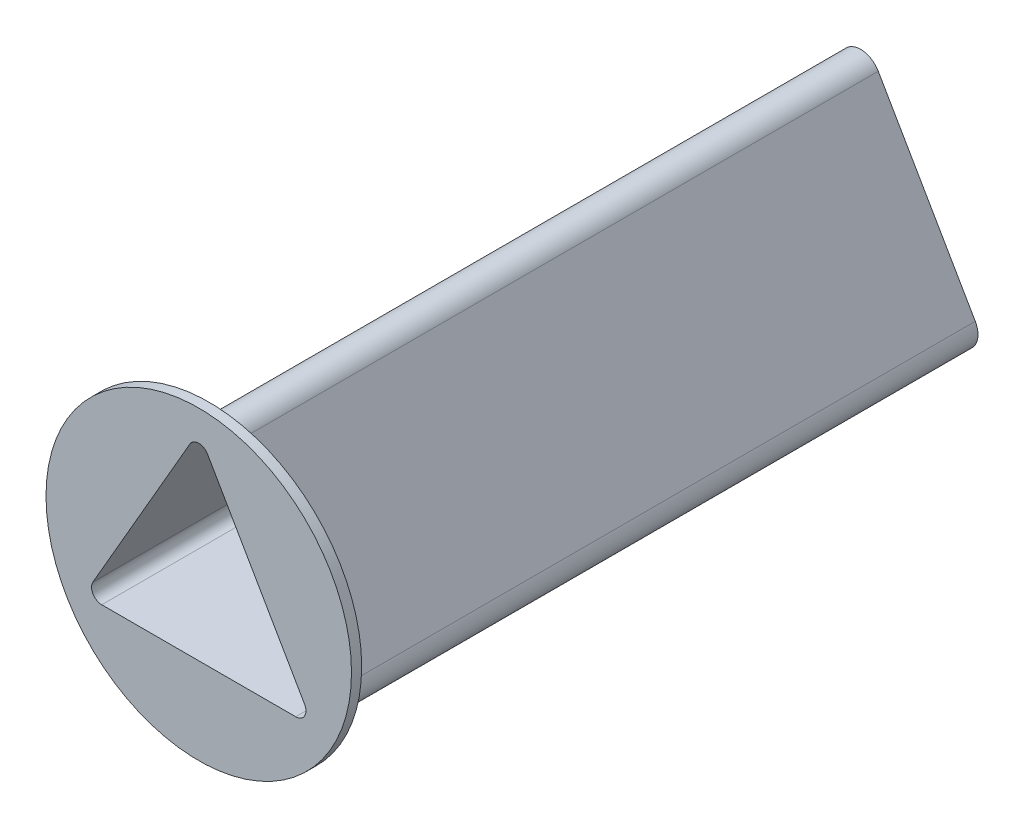
ISO-10303-21;
HEADER;
FILE_DESCRIPTION(('STEP AP214'),'2;1');
FILE_NAME('part.step','',(''),(''),'','','');
FILE_SCHEMA(('AUTOMOTIVE_DESIGN { 1 0 10303 214 1 1 1 1 }'));
ENDSEC;
DATA;
#1=APPLICATION_CONTEXT('core data for automotive mechanical design processes');
#2=APPLICATION_PROTOCOL_DEFINITION('international standard','automotive_design',2000,#1);
#3=PRODUCT_CONTEXT('',#1,'mechanical');
#4=PRODUCT('Part','Part','',(#3));
#5=PRODUCT_RELATED_PRODUCT_CATEGORY('part','',(#4));
#6=PRODUCT_DEFINITION_FORMATION('','',#4);
#7=PRODUCT_DEFINITION_CONTEXT('part definition',#1,'design');
#8=PRODUCT_DEFINITION('design','',#6,#7);
#9=PRODUCT_DEFINITION_SHAPE('','',#8);
#10=(LENGTH_UNIT() NAMED_UNIT(*) SI_UNIT(.MILLI.,.METRE.));
#11=(NAMED_UNIT(*) PLANE_ANGLE_UNIT() SI_UNIT($,.RADIAN.));
#12=(NAMED_UNIT(*) SI_UNIT($,.STERADIAN.) SOLID_ANGLE_UNIT());
#13=UNCERTAINTY_MEASURE_WITH_UNIT(LENGTH_MEASURE(1.E-05),#10,'distance_accuracy_value','');
#14=(GEOMETRIC_REPRESENTATION_CONTEXT(3) GLOBAL_UNCERTAINTY_ASSIGNED_CONTEXT((#13)) GLOBAL_UNIT_ASSIGNED_CONTEXT((#10,
#11,#12)) REPRESENTATION_CONTEXT('',''));
#15=CARTESIAN_POINT('',(0.,0.,0.));
#16=DIRECTION('',(0.,0.,1.));
#17=DIRECTION('',(1.,0.,0.));
#18=AXIS2_PLACEMENT_3D('',#15,#16,#17);
#19=CARTESIAN_POINT('',(0.,0.,65.));
#20=DIRECTION('',(0.,0.,1.));
#21=DIRECTION('',(1.,0.,0.));
#22=AXIS2_PLACEMENT_3D('',#19,#20,#21);
#23=PLANE('',#22);
#24=CARTESIAN_POINT('',(0.,0.,65.));
#25=DIRECTION('',(0.,0.,1.));
#26=DIRECTION('',(1.,0.,0.));
#27=AXIS2_PLACEMENT_3D('',#24,#25,#26);
#28=CIRCLE('',#27,15.);
#29=CARTESIAN_POINT('',(15.,0.,65.));
#30=VERTEX_POINT('',#29);
#31=EDGE_CURVE('E191',#30,#30,#28,.T.);
#32=ORIENTED_EDGE('',*,*,#31,.T.);
#33=EDGE_LOOP('',(#32));
#34=FACE_BOUND('',#33,.T.);
#35=DIRECTION('',(-0.5,-0.866025403784439,0.));
#36=VECTOR('',#35,1.);
#37=CARTESIAN_POINT('',(0.866025403784436,14.5,65.));
#38=LINE('',#37,#36);
#39=CARTESIAN_POINT('',(-0.866025403784439,11.5,65.));
#40=VERTEX_POINT('',#39);
#41=CARTESIAN_POINT('',(-10.3923048454133,-5.,65.));
#42=VERTEX_POINT('',#41);
#43=EDGE_CURVE('E166',#40,#42,#38,.T.);
#44=ORIENTED_EDGE('',*,*,#43,.F.);
#45=CARTESIAN_POINT('',(0.,11.,65.));
#46=DIRECTION('',(0.,0.,1.));
#47=DIRECTION('',(1.,0.,0.));
#48=AXIS2_PLACEMENT_3D('',#45,#46,#47);
#49=CIRCLE('',#48,1.);
#50=CARTESIAN_POINT('',(0.866025403784432,11.5,65.));
#51=VERTEX_POINT('',#50);
#52=EDGE_CURVE('E194',#40,#51,#49,.F.);
#53=ORIENTED_EDGE('',*,*,#52,.T.);
#54=DIRECTION('',(-0.5,0.866025403784439,0.));
#55=VECTOR('',#54,1.);
#56=CARTESIAN_POINT('',(12.1243556529821,-8.,65.));
#57=LINE('',#56,#55);
#58=CARTESIAN_POINT('',(10.3923048454133,-5.,65.));
#59=VERTEX_POINT('',#58);
#60=EDGE_CURVE('E163',#59,#51,#57,.T.);
#61=ORIENTED_EDGE('',*,*,#60,.F.);
#62=CARTESIAN_POINT('',(9.52627944162883,-5.5,65.));
#63=DIRECTION('',(0.,0.,1.));
#64=DIRECTION('',(1.,0.,0.));
#65=AXIS2_PLACEMENT_3D('',#62,#63,#64);
#66=CIRCLE('',#65,1.);
#67=CARTESIAN_POINT('',(9.52627944162882,-6.5,65.));
#68=VERTEX_POINT('',#67);
#69=EDGE_CURVE('E154',#59,#68,#66,.F.);
#70=ORIENTED_EDGE('',*,*,#69,.T.);
#71=DIRECTION('',(1.,0.,0.));
#72=VECTOR('',#71,1.);
#73=CARTESIAN_POINT('',(-12.9903810567666,-6.5,65.));
#74=LINE('',#73,#72);
#75=CARTESIAN_POINT('',(-9.52627944162883,-6.5,65.));
#76=VERTEX_POINT('',#75);
#77=EDGE_CURVE('E140',#76,#68,#74,.T.);
#78=ORIENTED_EDGE('',*,*,#77,.F.);
#79=CARTESIAN_POINT('',(-9.52627944162882,-5.5,65.));
#80=DIRECTION('',(0.,0.,1.));
#81=DIRECTION('',(1.,0.,0.));
#82=AXIS2_PLACEMENT_3D('',#79,#80,#81);
#83=CIRCLE('',#82,1.);
#84=EDGE_CURVE('E150',#76,#42,#83,.F.);
#85=ORIENTED_EDGE('',*,*,#84,.T.);
#86=EDGE_LOOP('',(#44,#53,#61,#70,#78,#85));
#87=FACE_BOUND('',#86,.T.);
#88=ADVANCED_FACE('F39',(#34,#87),#23,.T.);
#89=CARTESIAN_POINT('',(-12.9903810567666,-7.5,65.));
#90=DIRECTION('',(0.,1.,0.));
#91=DIRECTION('',(-1.,0.,0.));
#92=AXIS2_PLACEMENT_3D('',#89,#90,#91);
#93=PLANE('',#92);
#94=DIRECTION('',(1.,0.,0.));
#95=VECTOR('',#94,1.);
#96=CARTESIAN_POINT('',(-12.9903810567666,-7.5,64.));
#97=LINE('',#96,#95);
#98=CARTESIAN_POINT('',(-9.52627944162883,-7.5,64.));
#99=VERTEX_POINT('',#98);
#100=CARTESIAN_POINT('',(9.52627944162882,-7.5,64.));
#101=VERTEX_POINT('',#100);
#102=EDGE_CURVE('E203',#99,#101,#97,.T.);
#103=ORIENTED_EDGE('',*,*,#102,.F.);
#104=DIRECTION('',(0.,0.,-1.));
#105=VECTOR('',#104,1.);
#106=CARTESIAN_POINT('',(-9.52627944162882,-7.5,65.));
#107=LINE('',#106,#105);
#108=CARTESIAN_POINT('',(-9.52627944162883,-7.5,0.));
#109=VERTEX_POINT('',#108);
#110=EDGE_CURVE('E229',#99,#109,#107,.T.);
#111=ORIENTED_EDGE('',*,*,#110,.T.);
#112=DIRECTION('',(1.,0.,0.));
#113=VECTOR('',#112,1.);
#114=CARTESIAN_POINT('',(-12.9903810567666,-7.5,0.));
#115=LINE('',#114,#113);
#116=CARTESIAN_POINT('',(9.52627944162882,-7.5,0.));
#117=VERTEX_POINT('',#116);
#118=EDGE_CURVE('E217',#109,#117,#115,.T.);
#119=ORIENTED_EDGE('',*,*,#118,.T.);
#120=DIRECTION('',(0.,0.,-1.));
#121=VECTOR('',#120,1.);
#122=CARTESIAN_POINT('',(9.52627944162883,-7.5,65.));
#123=LINE('',#122,#121);
#124=EDGE_CURVE('E226',#117,#101,#123,.F.);
#125=ORIENTED_EDGE('',*,*,#124,.T.);
#126=EDGE_LOOP('',(#103,#111,#119,#125));
#127=FACE_BOUND('',#126,.T.);
#128=ADVANCED_FACE('F271',(#127),#93,.F.);
#129=CARTESIAN_POINT('',(12.9903810567666,-7.5,65.));
#130=DIRECTION('',(-0.866025403784439,-0.5,0.));
#131=DIRECTION('',(0.5,-0.866025403784439,0.));
#132=AXIS2_PLACEMENT_3D('',#129,#130,#131);
#133=PLANE('',#132);
#134=DIRECTION('',(-0.5,0.866025403784439,0.));
#135=VECTOR('',#134,1.);
#136=CARTESIAN_POINT('',(12.9903810567666,-7.5,64.));
#137=LINE('',#136,#135);
#138=CARTESIAN_POINT('',(11.2583302491977,-4.5,64.));
#139=VERTEX_POINT('',#138);
#140=CARTESIAN_POINT('',(1.73205080756888,12.,64.));
#141=VERTEX_POINT('',#140);
#142=EDGE_CURVE('E62',#139,#141,#137,.T.);
#143=ORIENTED_EDGE('',*,*,#142,.F.);
#144=DIRECTION('',(0.,0.,-1.));
#145=VECTOR('',#144,1.);
#146=CARTESIAN_POINT('',(11.2583302491977,-4.5,65.));
#147=LINE('',#146,#145);
#148=CARTESIAN_POINT('',(11.2583302491977,-4.5,0.));
#149=VERTEX_POINT('',#148);
#150=EDGE_CURVE('E47',#139,#149,#147,.T.);
#151=ORIENTED_EDGE('',*,*,#150,.T.);
#152=DIRECTION('',(-0.5,0.866025403784439,0.));
#153=VECTOR('',#152,1.);
#154=CARTESIAN_POINT('',(12.9903810567666,-7.5,0.));
#155=LINE('',#154,#153);
#156=CARTESIAN_POINT('',(1.73205080756887,12.,0.));
#157=VERTEX_POINT('',#156);
#158=EDGE_CURVE('E220',#149,#157,#155,.T.);
#159=ORIENTED_EDGE('',*,*,#158,.T.);
#160=DIRECTION('',(0.,0.,-1.));
#161=VECTOR('',#160,1.);
#162=CARTESIAN_POINT('',(1.73205080756888,12.,65.));
#163=LINE('',#162,#161);
#164=EDGE_CURVE('E242',#157,#141,#163,.F.);
#165=ORIENTED_EDGE('',*,*,#164,.T.);
#166=EDGE_LOOP('',(#143,#151,#159,#165));
#167=FACE_BOUND('',#166,.T.);
#168=ADVANCED_FACE('F247',(#167),#133,.F.);
#169=CARTESIAN_POINT('',(0.,15.,65.));
#170=DIRECTION('',(0.866025403784439,-0.5,0.));
#171=DIRECTION('',(0.5,0.866025403784439,0.));
#172=AXIS2_PLACEMENT_3D('',#169,#170,#171);
#173=PLANE('',#172);
#174=DIRECTION('',(-0.5,-0.866025403784439,0.));
#175=VECTOR('',#174,1.);
#176=CARTESIAN_POINT('',(0.,15.,64.));
#177=LINE('',#176,#175);
#178=CARTESIAN_POINT('',(-1.73205080756888,12.,64.));
#179=VERTEX_POINT('',#178);
#180=CARTESIAN_POINT('',(-11.2583302491977,-4.5,64.));
#181=VERTEX_POINT('',#180);
#182=EDGE_CURVE('E190',#179,#181,#177,.T.);
#183=ORIENTED_EDGE('',*,*,#182,.F.);
#184=DIRECTION('',(0.,0.,-1.));
#185=VECTOR('',#184,1.);
#186=CARTESIAN_POINT('',(-1.73205080756888,12.,65.));
#187=LINE('',#186,#185);
#188=CARTESIAN_POINT('',(-1.73205080756888,12.,0.));
#189=VERTEX_POINT('',#188);
#190=EDGE_CURVE('E237',#179,#189,#187,.T.);
#191=ORIENTED_EDGE('',*,*,#190,.T.);
#192=DIRECTION('',(-0.5,-0.866025403784439,0.));
#193=VECTOR('',#192,1.);
#194=CARTESIAN_POINT('',(0.,15.,0.));
#195=LINE('',#194,#193);
#196=CARTESIAN_POINT('',(-11.2583302491977,-4.5,0.));
#197=VERTEX_POINT('',#196);
#198=EDGE_CURVE('E223',#189,#197,#195,.T.);
#199=ORIENTED_EDGE('',*,*,#198,.T.);
#200=DIRECTION('',(0.,0.,-1.));
#201=VECTOR('',#200,1.);
#202=CARTESIAN_POINT('',(-11.2583302491977,-4.5,65.));
#203=LINE('',#202,#201);
#204=EDGE_CURVE('E239',#197,#181,#203,.F.);
#205=ORIENTED_EDGE('',*,*,#204,.T.);
#206=EDGE_LOOP('',(#183,#191,#199,#205));
#207=FACE_BOUND('',#206,.T.);
#208=ADVANCED_FACE('F263',(#207),#173,.F.);
#209=CARTESIAN_POINT('',(-9.52627944162882,-5.5,65.));
#210=DIRECTION('',(0.,0.,-1.));
#211=DIRECTION('',(-1.,0.,0.));
#212=AXIS2_PLACEMENT_3D('',#209,#210,#211);
#213=CYLINDRICAL_SURFACE('',#212,2.);
#214=ORIENTED_EDGE('',*,*,#110,.F.);
#215=CARTESIAN_POINT('',(-9.52627944162882,-5.5,64.));
#216=DIRECTION('',(0.,0.,1.));
#217=DIRECTION('',(1.,0.,0.));
#218=AXIS2_PLACEMENT_3D('',#215,#216,#217);
#219=CIRCLE('',#218,2.);
#220=EDGE_CURVE('E200',#99,#181,#219,.F.);
#221=ORIENTED_EDGE('',*,*,#220,.T.);
#222=ORIENTED_EDGE('',*,*,#204,.F.);
#223=CARTESIAN_POINT('',(-9.52627944162882,-5.5,0.));
#224=DIRECTION('',(0.,0.,1.));
#225=DIRECTION('',(1.,0.,0.));
#226=AXIS2_PLACEMENT_3D('',#223,#224,#225);
#227=CIRCLE('',#226,2.);
#228=EDGE_CURVE('E235',#109,#197,#227,.F.);
#229=ORIENTED_EDGE('',*,*,#228,.F.);
#230=EDGE_LOOP('',(#214,#221,#222,#229));
#231=FACE_BOUND('',#230,.T.);
#232=ADVANCED_FACE('F268',(#231),#213,.T.);
#233=CARTESIAN_POINT('',(9.52627944162883,-5.5,65.));
#234=DIRECTION('',(0.,0.,-1.));
#235=DIRECTION('',(-1.,0.,0.));
#236=AXIS2_PLACEMENT_3D('',#233,#234,#235);
#237=CYLINDRICAL_SURFACE('',#236,2.);
#238=ORIENTED_EDGE('',*,*,#150,.F.);
#239=CARTESIAN_POINT('',(9.52627944162883,-5.5,64.));
#240=DIRECTION('',(0.,0.,1.));
#241=DIRECTION('',(1.,0.,0.));
#242=AXIS2_PLACEMENT_3D('',#239,#240,#241);
#243=CIRCLE('',#242,2.);
#244=EDGE_CURVE('E197',#139,#101,#243,.F.);
#245=ORIENTED_EDGE('',*,*,#244,.T.);
#246=ORIENTED_EDGE('',*,*,#124,.F.);
#247=CARTESIAN_POINT('',(9.52627944162883,-5.5,0.));
#248=DIRECTION('',(0.,0.,1.));
#249=DIRECTION('',(1.,0.,0.));
#250=AXIS2_PLACEMENT_3D('',#247,#248,#249);
#251=CIRCLE('',#250,2.);
#252=EDGE_CURVE('E233',#149,#117,#251,.F.);
#253=ORIENTED_EDGE('',*,*,#252,.F.);
#254=EDGE_LOOP('',(#238,#245,#246,#253));
#255=FACE_BOUND('',#254,.T.);
#256=ADVANCED_FACE('F252',(#255),#237,.T.);
#257=CARTESIAN_POINT('',(0.,11.,65.));
#258=DIRECTION('',(0.,0.,-1.));
#259=DIRECTION('',(-1.,0.,0.));
#260=AXIS2_PLACEMENT_3D('',#257,#258,#259);
#261=CYLINDRICAL_SURFACE('',#260,2.);
#262=ORIENTED_EDGE('',*,*,#190,.F.);
#263=CARTESIAN_POINT('',(0.,11.,64.));
#264=DIRECTION('',(0.,0.,1.));
#265=DIRECTION('',(1.,0.,0.));
#266=AXIS2_PLACEMENT_3D('',#263,#264,#265);
#267=CIRCLE('',#266,2.);
#268=EDGE_CURVE('E11',#179,#141,#267,.F.);
#269=ORIENTED_EDGE('',*,*,#268,.T.);
#270=ORIENTED_EDGE('',*,*,#164,.F.);
#271=CARTESIAN_POINT('',(0.,11.,0.));
#272=DIRECTION('',(0.,0.,1.));
#273=DIRECTION('',(1.,0.,0.));
#274=AXIS2_PLACEMENT_3D('',#271,#272,#273);
#275=CIRCLE('',#274,2.);
#276=EDGE_CURVE('E231',#189,#157,#275,.F.);
#277=ORIENTED_EDGE('',*,*,#276,.F.);
#278=EDGE_LOOP('',(#262,#269,#270,#277));
#279=FACE_BOUND('',#278,.T.);
#280=ADVANCED_FACE('F41',(#279),#261,.T.);
#281=CARTESIAN_POINT('',(0.,0.,0.));
#282=DIRECTION('',(0.,0.,1.));
#283=DIRECTION('',(1.,0.,0.));
#284=AXIS2_PLACEMENT_3D('',#281,#282,#283);
#285=PLANE('',#284);
#286=CARTESIAN_POINT('',(0.,-3.,0.));
#287=DIRECTION('',(0.,0.,-1.));
#288=DIRECTION('',(-1.,0.,0.));
#289=AXIS2_PLACEMENT_3D('',#286,#287,#288);
#290=CIRCLE('',#289,1.65);
#291=CARTESIAN_POINT('',(-1.65,-3.,0.));
#292=VERTEX_POINT('',#291);
#293=EDGE_CURVE('E205',#292,#292,#290,.T.);
#294=ORIENTED_EDGE('',*,*,#293,.F.);
#295=EDGE_LOOP('',(#294));
#296=FACE_BOUND('',#295,.T.);
#297=CARTESIAN_POINT('',(0.,7.,0.));
#298=DIRECTION('',(0.,0.,-1.));
#299=DIRECTION('',(-1.,0.,0.));
#300=AXIS2_PLACEMENT_3D('',#297,#298,#299);
#301=CIRCLE('',#300,1.65);
#302=CARTESIAN_POINT('',(-1.65,7.,0.));
#303=VERTEX_POINT('',#302);
#304=EDGE_CURVE('E211',#303,#303,#301,.T.);
#305=ORIENTED_EDGE('',*,*,#304,.F.);
#306=EDGE_LOOP('',(#305));
#307=FACE_BOUND('',#306,.T.);
#308=ORIENTED_EDGE('',*,*,#118,.F.);
#309=ORIENTED_EDGE('',*,*,#228,.T.);
#310=ORIENTED_EDGE('',*,*,#198,.F.);
#311=ORIENTED_EDGE('',*,*,#276,.T.);
#312=ORIENTED_EDGE('',*,*,#158,.F.);
#313=ORIENTED_EDGE('',*,*,#252,.T.);
#314=EDGE_LOOP('',(#308,#309,#310,#311,#312,#313));
#315=FACE_BOUND('',#314,.T.);
#316=ADVANCED_FACE('F255',(#296,#307,#315),#285,.F.);
#317=CARTESIAN_POINT('',(0.,7.,13.));
#318=DIRECTION('',(0.,0.,-1.));
#319=DIRECTION('',(-1.,0.,0.));
#320=AXIS2_PLACEMENT_3D('',#317,#318,#319);
#321=CONICAL_SURFACE('',#320,1.65,1.02974425867665);
#322=CARTESIAN_POINT('',(0.,7.,13.9914200213955));
#323=VERTEX_POINT('',#322);
#324=VERTEX_LOOP('',#323);
#325=FACE_BOUND('',#324,.T.);
#326=CARTESIAN_POINT('',(0.,7.,13.));
#327=DIRECTION('',(0.,0.,-1.));
#328=DIRECTION('',(-1.,0.,0.));
#329=AXIS2_PLACEMENT_3D('',#326,#327,#328);
#330=CIRCLE('',#329,1.65);
#331=CARTESIAN_POINT('',(-1.65,7.,13.));
#332=VERTEX_POINT('',#331);
#333=EDGE_CURVE('E214',#332,#332,#330,.T.);
#334=ORIENTED_EDGE('',*,*,#333,.T.);
#335=EDGE_LOOP('',(#334));
#336=FACE_BOUND('',#335,.T.);
#337=ADVANCED_FACE('F291',(#325,#336),#321,.F.);
#338=CARTESIAN_POINT('',(0.,7.,0.));
#339=DIRECTION('',(0.,0.,-1.));
#340=DIRECTION('',(-1.,0.,0.));
#341=AXIS2_PLACEMENT_3D('',#338,#339,#340);
#342=CYLINDRICAL_SURFACE('',#341,1.65);
#343=ORIENTED_EDGE('',*,*,#333,.F.);
#344=EDGE_LOOP('',(#343));
#345=FACE_BOUND('',#344,.T.);
#346=ORIENTED_EDGE('',*,*,#304,.T.);
#347=EDGE_LOOP('',(#346));
#348=FACE_BOUND('',#347,.T.);
#349=ADVANCED_FACE('F297',(#345,#348),#342,.F.);
#350=CARTESIAN_POINT('',(0.,-3.,13.));
#351=DIRECTION('',(0.,0.,-1.));
#352=DIRECTION('',(-1.,0.,0.));
#353=AXIS2_PLACEMENT_3D('',#350,#351,#352);
#354=CONICAL_SURFACE('',#353,1.65,1.02974425867665);
#355=CARTESIAN_POINT('',(0.,-3.,13.9914200213955));
#356=VERTEX_POINT('',#355);
#357=VERTEX_LOOP('',#356);
#358=FACE_BOUND('',#357,.T.);
#359=CARTESIAN_POINT('',(0.,-3.,13.));
#360=DIRECTION('',(0.,0.,-1.));
#361=DIRECTION('',(-1.,0.,0.));
#362=AXIS2_PLACEMENT_3D('',#359,#360,#361);
#363=CIRCLE('',#362,1.65);
#364=CARTESIAN_POINT('',(-1.65,-3.,13.));
#365=VERTEX_POINT('',#364);
#366=EDGE_CURVE('E208',#365,#365,#363,.T.);
#367=ORIENTED_EDGE('',*,*,#366,.T.);
#368=EDGE_LOOP('',(#367));
#369=FACE_BOUND('',#368,.T.);
#370=ADVANCED_FACE('F470',(#358,#369),#354,.F.);
#371=CARTESIAN_POINT('',(0.,-3.,0.));
#372=DIRECTION('',(0.,0.,-1.));
#373=DIRECTION('',(-1.,0.,0.));
#374=AXIS2_PLACEMENT_3D('',#371,#372,#373);
#375=CYLINDRICAL_SURFACE('',#374,1.65);
#376=ORIENTED_EDGE('',*,*,#366,.F.);
#377=EDGE_LOOP('',(#376));
#378=FACE_BOUND('',#377,.T.);
#379=ORIENTED_EDGE('',*,*,#293,.T.);
#380=EDGE_LOOP('',(#379));
#381=FACE_BOUND('',#380,.T.);
#382=ADVANCED_FACE('F330',(#378,#381),#375,.F.);
#383=CARTESIAN_POINT('',(0.,0.,64.));
#384=DIRECTION('',(0.,0.,1.));
#385=DIRECTION('',(1.,0.,0.));
#386=AXIS2_PLACEMENT_3D('',#383,#384,#385);
#387=PLANE('',#386);
#388=CARTESIAN_POINT('',(0.,0.,64.));
#389=DIRECTION('',(0.,0.,1.));
#390=DIRECTION('',(1.,0.,0.));
#391=AXIS2_PLACEMENT_3D('',#388,#389,#390);
#392=CIRCLE('',#391,15.);
#393=CARTESIAN_POINT('',(15.,0.,64.));
#394=VERTEX_POINT('',#393);
#395=EDGE_CURVE('E187',#394,#394,#392,.T.);
#396=ORIENTED_EDGE('',*,*,#395,.F.);
#397=EDGE_LOOP('',(#396));
#398=FACE_BOUND('',#397,.T.);
#399=ORIENTED_EDGE('',*,*,#220,.F.);
#400=ORIENTED_EDGE('',*,*,#102,.T.);
#401=ORIENTED_EDGE('',*,*,#244,.F.);
#402=ORIENTED_EDGE('',*,*,#142,.T.);
#403=ORIENTED_EDGE('',*,*,#268,.F.);
#404=ORIENTED_EDGE('',*,*,#182,.T.);
#405=EDGE_LOOP('',(#399,#400,#401,#402,#403,#404));
#406=FACE_BOUND('',#405,.T.);
#407=ADVANCED_FACE('F261',(#398,#406),#387,.F.);
#408=CARTESIAN_POINT('',(0.,0.,64.));
#409=DIRECTION('',(0.,0.,1.));
#410=DIRECTION('',(1.,0.,0.));
#411=AXIS2_PLACEMENT_3D('',#408,#409,#410);
#412=CYLINDRICAL_SURFACE('',#411,15.);
#413=ORIENTED_EDGE('',*,*,#395,.T.);
#414=EDGE_LOOP('',(#413));
#415=FACE_BOUND('',#414,.T.);
#416=ORIENTED_EDGE('',*,*,#31,.F.);
#417=EDGE_LOOP('',(#416));
#418=FACE_BOUND('',#417,.T.);
#419=ADVANCED_FACE('F329',(#415,#418),#412,.T.);
#420=CARTESIAN_POINT('',(-12.9903810567666,-6.5,65.));
#421=DIRECTION('',(0.,1.,0.));
#422=DIRECTION('',(-1.,0.,0.));
#423=AXIS2_PLACEMENT_3D('',#420,#421,#422);
#424=PLANE('',#423);
#425=ORIENTED_EDGE('',*,*,#77,.T.);
#426=DIRECTION('',(0.,0.,1.));
#427=VECTOR('',#426,1.);
#428=CARTESIAN_POINT('',(9.52627944162882,-6.5,65.));
#429=LINE('',#428,#427);
#430=CARTESIAN_POINT('',(9.52627944162882,-6.5,1.));
#431=VERTEX_POINT('',#430);
#432=EDGE_CURVE('E144',#431,#68,#429,.T.);
#433=ORIENTED_EDGE('',*,*,#432,.F.);
#434=DIRECTION('',(1.,0.,0.));
#435=VECTOR('',#434,1.);
#436=CARTESIAN_POINT('',(-12.9903810567666,-6.5,1.));
#437=LINE('',#436,#435);
#438=CARTESIAN_POINT('',(-9.52627944162883,-6.5,1.));
#439=VERTEX_POINT('',#438);
#440=EDGE_CURVE('E184',#439,#431,#437,.T.);
#441=ORIENTED_EDGE('',*,*,#440,.F.);
#442=DIRECTION('',(0.,0.,1.));
#443=VECTOR('',#442,1.);
#444=CARTESIAN_POINT('',(-9.52627944162883,-6.5,65.));
#445=LINE('',#444,#443);
#446=EDGE_CURVE('E145',#76,#439,#445,.F.);
#447=ORIENTED_EDGE('',*,*,#446,.F.);
#448=EDGE_LOOP('',(#425,#433,#441,#447));
#449=FACE_BOUND('',#448,.T.);
#450=ADVANCED_FACE('F142',(#449),#424,.T.);
#451=CARTESIAN_POINT('',(12.1243556529821,-8.,65.));
#452=DIRECTION('',(-0.866025403784439,-0.5,0.));
#453=DIRECTION('',(0.5,-0.866025403784439,0.));
#454=AXIS2_PLACEMENT_3D('',#451,#452,#453);
#455=PLANE('',#454);
#456=ORIENTED_EDGE('',*,*,#60,.T.);
#457=DIRECTION('',(0.,0.,1.));
#458=VECTOR('',#457,1.);
#459=CARTESIAN_POINT('',(0.866025403784432,11.5,65.));
#460=LINE('',#459,#458);
#461=CARTESIAN_POINT('',(0.866025403784432,11.5,1.));
#462=VERTEX_POINT('',#461);
#463=EDGE_CURVE('E540',#462,#51,#460,.T.);
#464=ORIENTED_EDGE('',*,*,#463,.F.);
#465=DIRECTION('',(-0.5,0.866025403784439,0.));
#466=VECTOR('',#465,1.);
#467=CARTESIAN_POINT('',(12.1243556529821,-8.,1.));
#468=LINE('',#467,#466);
#469=CARTESIAN_POINT('',(10.3923048454133,-5.,1.));
#470=VERTEX_POINT('',#469);
#471=EDGE_CURVE('E170',#470,#462,#468,.T.);
#472=ORIENTED_EDGE('',*,*,#471,.F.);
#473=DIRECTION('',(0.,0.,1.));
#474=VECTOR('',#473,1.);
#475=CARTESIAN_POINT('',(10.3923048454133,-5.,65.));
#476=LINE('',#475,#474);
#477=EDGE_CURVE('E54',#59,#470,#476,.F.);
#478=ORIENTED_EDGE('',*,*,#477,.F.);
#479=EDGE_LOOP('',(#456,#464,#472,#478));
#480=FACE_BOUND('',#479,.T.);
#481=ADVANCED_FACE('F358',(#480),#455,.T.);
#482=CARTESIAN_POINT('',(0.866025403784436,14.5,65.));
#483=DIRECTION('',(0.866025403784439,-0.5,0.));
#484=DIRECTION('',(0.5,0.866025403784439,0.));
#485=AXIS2_PLACEMENT_3D('',#482,#483,#484);
#486=PLANE('',#485);
#487=ORIENTED_EDGE('',*,*,#43,.T.);
#488=DIRECTION('',(0.,0.,1.));
#489=VECTOR('',#488,1.);
#490=CARTESIAN_POINT('',(-10.3923048454133,-5.,65.));
#491=LINE('',#490,#489);
#492=CARTESIAN_POINT('',(-10.3923048454133,-5.,1.));
#493=VERTEX_POINT('',#492);
#494=EDGE_CURVE('E537',#493,#42,#491,.T.);
#495=ORIENTED_EDGE('',*,*,#494,.F.);
#496=DIRECTION('',(-0.5,-0.866025403784439,0.));
#497=VECTOR('',#496,1.);
#498=CARTESIAN_POINT('',(0.866025403784436,14.5,1.));
#499=LINE('',#498,#497);
#500=CARTESIAN_POINT('',(-0.866025403784439,11.5,1.));
#501=VERTEX_POINT('',#500);
#502=EDGE_CURVE('E159',#501,#493,#499,.T.);
#503=ORIENTED_EDGE('',*,*,#502,.F.);
#504=DIRECTION('',(0.,0.,1.));
#505=VECTOR('',#504,1.);
#506=CARTESIAN_POINT('',(-0.866025403784439,11.5,65.));
#507=LINE('',#506,#505);
#508=EDGE_CURVE('E541',#40,#501,#507,.F.);
#509=ORIENTED_EDGE('',*,*,#508,.F.);
#510=EDGE_LOOP('',(#487,#495,#503,#509));
#511=FACE_BOUND('',#510,.T.);
#512=ADVANCED_FACE('F367',(#511),#486,.T.);
#513=CARTESIAN_POINT('',(-9.52627944162882,-5.5,65.));
#514=DIRECTION('',(0.,0.,-1.));
#515=DIRECTION('',(-1.,0.,0.));
#516=AXIS2_PLACEMENT_3D('',#513,#514,#515);
#517=CYLINDRICAL_SURFACE('',#516,1.);
#518=ORIENTED_EDGE('',*,*,#446,.T.);
#519=CARTESIAN_POINT('',(-9.52627944162882,-5.5,1.));
#520=DIRECTION('',(0.,0.,1.));
#521=DIRECTION('',(1.,0.,0.));
#522=AXIS2_PLACEMENT_3D('',#519,#520,#521);
#523=CIRCLE('',#522,1.);
#524=EDGE_CURVE('E173',#439,#493,#523,.F.);
#525=ORIENTED_EDGE('',*,*,#524,.T.);
#526=ORIENTED_EDGE('',*,*,#494,.T.);
#527=ORIENTED_EDGE('',*,*,#84,.F.);
#528=EDGE_LOOP('',(#518,#525,#526,#527));
#529=FACE_BOUND('',#528,.T.);
#530=ADVANCED_FACE('F376',(#529),#517,.F.);
#531=CARTESIAN_POINT('',(9.52627944162883,-5.5,65.));
#532=DIRECTION('',(0.,0.,-1.));
#533=DIRECTION('',(-1.,0.,0.));
#534=AXIS2_PLACEMENT_3D('',#531,#532,#533);
#535=CYLINDRICAL_SURFACE('',#534,1.);
#536=ORIENTED_EDGE('',*,*,#477,.T.);
#537=CARTESIAN_POINT('',(9.52627944162883,-5.5,1.));
#538=DIRECTION('',(0.,0.,1.));
#539=DIRECTION('',(1.,0.,0.));
#540=AXIS2_PLACEMENT_3D('',#537,#538,#539);
#541=CIRCLE('',#540,1.);
#542=EDGE_CURVE('E157',#470,#431,#541,.F.);
#543=ORIENTED_EDGE('',*,*,#542,.T.);
#544=ORIENTED_EDGE('',*,*,#432,.T.);
#545=ORIENTED_EDGE('',*,*,#69,.F.);
#546=EDGE_LOOP('',(#536,#543,#544,#545));
#547=FACE_BOUND('',#546,.T.);
#548=ADVANCED_FACE('F153',(#547),#535,.F.);
#549=CARTESIAN_POINT('',(0.,11.,65.));
#550=DIRECTION('',(0.,0.,-1.));
#551=DIRECTION('',(-1.,0.,0.));
#552=AXIS2_PLACEMENT_3D('',#549,#550,#551);
#553=CYLINDRICAL_SURFACE('',#552,1.);
#554=ORIENTED_EDGE('',*,*,#508,.T.);
#555=CARTESIAN_POINT('',(0.,11.,1.));
#556=DIRECTION('',(0.,0.,1.));
#557=DIRECTION('',(1.,0.,0.));
#558=AXIS2_PLACEMENT_3D('',#555,#556,#557);
#559=CIRCLE('',#558,1.);
#560=EDGE_CURVE('E174',#501,#462,#559,.F.);
#561=ORIENTED_EDGE('',*,*,#560,.T.);
#562=ORIENTED_EDGE('',*,*,#463,.T.);
#563=ORIENTED_EDGE('',*,*,#52,.F.);
#564=EDGE_LOOP('',(#554,#561,#562,#563));
#565=FACE_BOUND('',#564,.T.);
#566=ADVANCED_FACE('F395',(#565),#553,.F.);
#567=CARTESIAN_POINT('',(0.,0.,1.));
#568=DIRECTION('',(0.,0.,1.));
#569=DIRECTION('',(1.,0.,0.));
#570=AXIS2_PLACEMENT_3D('',#567,#568,#569);
#571=PLANE('',#570);
#572=CARTESIAN_POINT('',(0.,-3.,1.));
#573=DIRECTION('',(0.,0.,1.));
#574=DIRECTION('',(1.,0.,0.));
#575=AXIS2_PLACEMENT_3D('',#572,#573,#574);
#576=CIRCLE('',#575,2.65);
#577=CARTESIAN_POINT('',(2.65,-3.,1.));
#578=VERTEX_POINT('',#577);
#579=EDGE_CURVE('E149',#578,#578,#576,.F.);
#580=ORIENTED_EDGE('',*,*,#579,.T.);
#581=EDGE_LOOP('',(#580));
#582=FACE_BOUND('',#581,.T.);
#583=CARTESIAN_POINT('',(0.,7.,1.));
#584=DIRECTION('',(0.,0.,1.));
#585=DIRECTION('',(1.,0.,0.));
#586=AXIS2_PLACEMENT_3D('',#583,#584,#585);
#587=CIRCLE('',#586,2.65);
#588=CARTESIAN_POINT('',(2.65,7.,1.));
#589=VERTEX_POINT('',#588);
#590=EDGE_CURVE('E178',#589,#589,#587,.F.);
#591=ORIENTED_EDGE('',*,*,#590,.T.);
#592=EDGE_LOOP('',(#591));
#593=FACE_BOUND('',#592,.T.);
#594=ORIENTED_EDGE('',*,*,#440,.T.);
#595=ORIENTED_EDGE('',*,*,#542,.F.);
#596=ORIENTED_EDGE('',*,*,#471,.T.);
#597=ORIENTED_EDGE('',*,*,#560,.F.);
#598=ORIENTED_EDGE('',*,*,#502,.T.);
#599=ORIENTED_EDGE('',*,*,#524,.F.);
#600=EDGE_LOOP('',(#594,#595,#596,#597,#598,#599));
#601=FACE_BOUND('',#600,.T.);
#602=ADVANCED_FACE('F404',(#582,#593,#601),#571,.T.);
#603=CARTESIAN_POINT('',(0.,7.,13.8571673007021));
#604=DIRECTION('',(0.,0.,-1.));
#605=DIRECTION('',(-1.,0.,0.));
#606=AXIS2_PLACEMENT_3D('',#603,#604,#605);
#607=CONICAL_SURFACE('',#606,2.16503807491005,1.02974425867665);
#608=CARTESIAN_POINT('',(0.,7.,15.1580534186108));
#609=VERTEX_POINT('',#608);
#610=VERTEX_LOOP('',#609);
#611=FACE_BOUND('',#610,.T.);
#612=CARTESIAN_POINT('',(0.,7.,13.5657727781878));
#613=DIRECTION('',(0.,0.,-1.));
#614=DIRECTION('',(-1.,0.,0.));
#615=AXIS2_PLACEMENT_3D('',#612,#613,#614);
#616=CIRCLE('',#615,2.65);
#617=CARTESIAN_POINT('',(-2.65,7.,13.5657727781878));
#618=VERTEX_POINT('',#617);
#619=EDGE_CURVE('E181',#618,#618,#616,.T.);
#620=ORIENTED_EDGE('',*,*,#619,.F.);
#621=EDGE_LOOP('',(#620));
#622=FACE_BOUND('',#621,.T.);
#623=ADVANCED_FACE('F414',(#611,#622),#607,.T.);
#624=CARTESIAN_POINT('',(0.,7.,0.));
#625=DIRECTION('',(0.,0.,-1.));
#626=DIRECTION('',(-1.,0.,0.));
#627=AXIS2_PLACEMENT_3D('',#624,#625,#626);
#628=CYLINDRICAL_SURFACE('',#627,2.65);
#629=ORIENTED_EDGE('',*,*,#619,.T.);
#630=EDGE_LOOP('',(#629));
#631=FACE_BOUND('',#630,.T.);
#632=ORIENTED_EDGE('',*,*,#590,.F.);
#633=EDGE_LOOP('',(#632));
#634=FACE_BOUND('',#633,.T.);
#635=ADVANCED_FACE('F424',(#631,#634),#628,.T.);
#636=CARTESIAN_POINT('',(0.,-3.,13.8571673007021));
#637=DIRECTION('',(0.,0.,-1.));
#638=DIRECTION('',(-1.,0.,0.));
#639=AXIS2_PLACEMENT_3D('',#636,#637,#638);
#640=CONICAL_SURFACE('',#639,2.16503807491005,1.02974425867665);
#641=CARTESIAN_POINT('',(0.,-3.,15.1580534186108));
#642=VERTEX_POINT('',#641);
#643=VERTEX_LOOP('',#642);
#644=FACE_BOUND('',#643,.T.);
#645=CARTESIAN_POINT('',(0.,-3.,13.5657727781878));
#646=DIRECTION('',(0.,0.,-1.));
#647=DIRECTION('',(-1.,0.,0.));
#648=AXIS2_PLACEMENT_3D('',#645,#646,#647);
#649=CIRCLE('',#648,2.65);
#650=CARTESIAN_POINT('',(-2.65,-3.,13.5657727781878));
#651=VERTEX_POINT('',#650);
#652=EDGE_CURVE('E177',#651,#651,#649,.T.);
#653=ORIENTED_EDGE('',*,*,#652,.F.);
#654=EDGE_LOOP('',(#653));
#655=FACE_BOUND('',#654,.T.);
#656=ADVANCED_FACE('F435',(#644,#655),#640,.T.);
#657=CARTESIAN_POINT('',(0.,-3.,0.));
#658=DIRECTION('',(0.,0.,-1.));
#659=DIRECTION('',(-1.,0.,0.));
#660=AXIS2_PLACEMENT_3D('',#657,#658,#659);
#661=CYLINDRICAL_SURFACE('',#660,2.65);
#662=ORIENTED_EDGE('',*,*,#652,.T.);
#663=EDGE_LOOP('',(#662));
#664=FACE_BOUND('',#663,.T.);
#665=ORIENTED_EDGE('',*,*,#579,.F.);
#666=EDGE_LOOP('',(#665));
#667=FACE_BOUND('',#666,.T.);
#668=ADVANCED_FACE('F448',(#664,#667),#661,.T.);
#669=CLOSED_SHELL('',(#88,#128,#168,#208,#232,#256,#280,#316,#337,#349,#370,#382,#407,#419,#450,
#481,#512,#530,#548,#566,#602,#623,#635,#656,#668));
#670=MANIFOLD_SOLID_BREP('B2',#669);
#671=ADVANCED_BREP_SHAPE_REPRESENTATION('',(#18,#670),#14);
#672=SHAPE_DEFINITION_REPRESENTATION(#9,#671);
ENDSEC;
END-ISO-10303-21;
